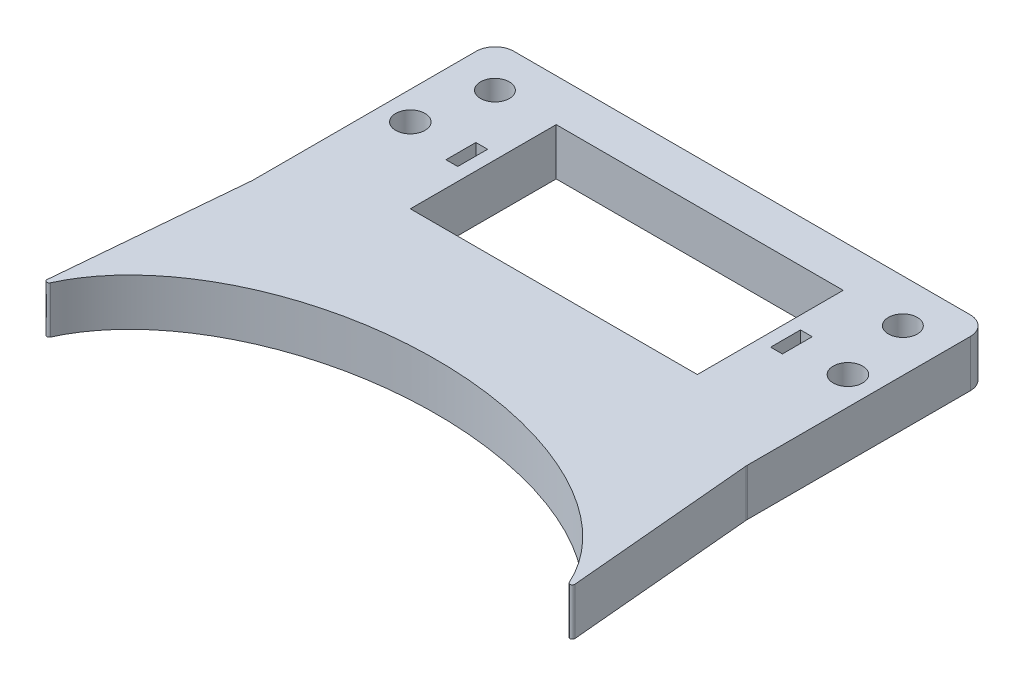
ISO-10303-21;
HEADER;
FILE_DESCRIPTION(('STEP AP214'),'2;1');
FILE_NAME('part.step','',(''),(''),'','','');
FILE_SCHEMA(('AUTOMOTIVE_DESIGN { 1 0 10303 214 1 1 1 1 }'));
ENDSEC;
DATA;
#1=APPLICATION_CONTEXT('core data for automotive mechanical design processes');
#2=APPLICATION_PROTOCOL_DEFINITION('international standard','automotive_design',2000,#1);
#3=PRODUCT_CONTEXT('',#1,'mechanical');
#4=PRODUCT('Part','Part','',(#3));
#5=PRODUCT_RELATED_PRODUCT_CATEGORY('part','',(#4));
#6=PRODUCT_DEFINITION_FORMATION('','',#4);
#7=PRODUCT_DEFINITION_CONTEXT('part definition',#1,'design');
#8=PRODUCT_DEFINITION('design','',#6,#7);
#9=PRODUCT_DEFINITION_SHAPE('','',#8);
#10=(LENGTH_UNIT() NAMED_UNIT(*) SI_UNIT(.MILLI.,.METRE.));
#11=(NAMED_UNIT(*) PLANE_ANGLE_UNIT() SI_UNIT($,.RADIAN.));
#12=(NAMED_UNIT(*) SI_UNIT($,.STERADIAN.) SOLID_ANGLE_UNIT());
#13=UNCERTAINTY_MEASURE_WITH_UNIT(LENGTH_MEASURE(1.E-05),#10,'distance_accuracy_value','');
#14=(GEOMETRIC_REPRESENTATION_CONTEXT(3) GLOBAL_UNCERTAINTY_ASSIGNED_CONTEXT((#13)) GLOBAL_UNIT_ASSIGNED_CONTEXT((#10,
#11,#12)) REPRESENTATION_CONTEXT('',''));
#15=CARTESIAN_POINT('',(0.,0.,0.));
#16=DIRECTION('',(0.,0.,1.));
#17=DIRECTION('',(1.,0.,0.));
#18=AXIS2_PLACEMENT_3D('',#15,#16,#17);
#19=CARTESIAN_POINT('',(0.,10.,0.));
#20=DIRECTION('',(0.,-1.,0.));
#21=DIRECTION('',(0.,0.,-1.));
#22=AXIS2_PLACEMENT_3D('',#19,#20,#21);
#23=PLANE('',#22);
#24=CARTESIAN_POINT('',(43.347709835329,10.,-23.3308146149369));
#25=DIRECTION('',(0.,-1.,0.));
#26=DIRECTION('',(0.,0.,1.));
#27=AXIS2_PLACEMENT_3D('',#24,#25,#26);
#28=CIRCLE('',#27,3.075);
#29=CARTESIAN_POINT('',(43.347709835329,10.,-20.2558146149369));
#30=VERTEX_POINT('',#29);
#31=EDGE_CURVE('E523',#30,#30,#28,.T.);
#32=ORIENTED_EDGE('',*,*,#31,.T.);
#33=EDGE_LOOP('',(#32));
#34=FACE_BOUND('',#33,.T.);
#35=CARTESIAN_POINT('',(0.,9.99999999999999,70.));
#36=DIRECTION('',(0.,1.,0.));
#37=DIRECTION('',(-1.,0.,0.));
#38=AXIS2_PLACEMENT_3D('',#35,#36,#37);
#39=ELLIPSE('',#38,57.5,37.5);
#40=CARTESIAN_POINT('',(-55.1298089989942,9.99999999999999,59.3443052899065));
#41=VERTEX_POINT('',#40);
#42=CARTESIAN_POINT('',(55.1298089989942,9.99999999999999,59.3443052899065));
#43=VERTEX_POINT('',#42);
#44=EDGE_CURVE('E254',#41,#43,#39,.F.);
#45=ORIENTED_EDGE('',*,*,#44,.T.);
#46=CARTESIAN_POINT('',(55.585011775336,10.,59.1374468058874));
#47=DIRECTION('',(0.,-1.,0.));
#48=DIRECTION('',(0.,0.,-1.));
#49=AXIS2_PLACEMENT_3D('',#46,#47,#48);
#50=CIRCLE('',#49,0.5);
#51=CARTESIAN_POINT('',(56.0830231384675,9.99999999999999,59.092897033812));
#52=VERTEX_POINT('',#51);
#53=EDGE_CURVE('E45',#43,#52,#50,.F.);
#54=ORIENTED_EDGE('',*,*,#53,.T.);
#55=DIRECTION('',(-0.0890995441508282,0.,-0.996022726262867));
#56=VECTOR('',#55,1.);
#57=CARTESIAN_POINT('',(50.3935859845895,9.99999999999999,-4.50797498988742));
#58=LINE('',#57,#56);
#59=CARTESIAN_POINT('',(52.5159090949485,9.99999999999999,19.2169729942694));
#60=VERTEX_POINT('',#59);
#61=EDGE_CURVE('E237',#52,#60,#58,.T.);
#62=ORIENTED_EDGE('',*,*,#61,.T.);
#63=CARTESIAN_POINT('',(56.5,10.,18.8605748176661));
#64=DIRECTION('',(0.,-1.,0.));
#65=DIRECTION('',(0.,0.,-1.));
#66=AXIS2_PLACEMENT_3D('',#63,#64,#65);
#67=CIRCLE('',#66,4.);
#68=CARTESIAN_POINT('',(52.5,10.,18.8605748176661));
#69=VERTEX_POINT('',#68);
#70=EDGE_CURVE('E364',#60,#69,#67,.T.);
#71=ORIENTED_EDGE('',*,*,#70,.T.);
#72=DIRECTION('',(0.,0.,-1.));
#73=VECTOR('',#72,1.);
#74=CARTESIAN_POINT('',(52.5,10.,32.5));
#75=LINE('',#74,#73);
#76=CARTESIAN_POINT('',(52.5,10.,-28.5));
#77=VERTEX_POINT('',#76);
#78=EDGE_CURVE('E406',#69,#77,#75,.T.);
#79=ORIENTED_EDGE('',*,*,#78,.T.);
#80=CARTESIAN_POINT('',(48.5,10.,-28.5));
#81=DIRECTION('',(0.,-1.,0.));
#82=DIRECTION('',(0.,0.,-1.));
#83=AXIS2_PLACEMENT_3D('',#80,#81,#82);
#84=CIRCLE('',#83,4.);
#85=CARTESIAN_POINT('',(48.5,10.,-32.5));
#86=VERTEX_POINT('',#85);
#87=EDGE_CURVE('E373',#77,#86,#84,.F.);
#88=ORIENTED_EDGE('',*,*,#87,.T.);
#89=DIRECTION('',(-1.,0.,0.));
#90=VECTOR('',#89,1.);
#91=CARTESIAN_POINT('',(-52.5,10.,-32.5));
#92=LINE('',#91,#90);
#93=CARTESIAN_POINT('',(-48.5,10.,-32.5));
#94=VERTEX_POINT('',#93);
#95=EDGE_CURVE('E416',#86,#94,#92,.T.);
#96=ORIENTED_EDGE('',*,*,#95,.T.);
#97=CARTESIAN_POINT('',(-48.5,10.,-28.5));
#98=DIRECTION('',(0.,-1.,0.));
#99=DIRECTION('',(0.,0.,-1.));
#100=AXIS2_PLACEMENT_3D('',#97,#98,#99);
#101=CIRCLE('',#100,4.);
#102=CARTESIAN_POINT('',(-52.5,10.,-28.5));
#103=VERTEX_POINT('',#102);
#104=EDGE_CURVE('E375',#94,#103,#101,.F.);
#105=ORIENTED_EDGE('',*,*,#104,.T.);
#106=DIRECTION('',(0.,0.,1.));
#107=VECTOR('',#106,1.);
#108=CARTESIAN_POINT('',(-52.5,10.,32.5));
#109=LINE('',#108,#107);
#110=CARTESIAN_POINT('',(-52.5,10.,18.8605748176661));
#111=VERTEX_POINT('',#110);
#112=EDGE_CURVE('E402',#103,#111,#109,.T.);
#113=ORIENTED_EDGE('',*,*,#112,.T.);
#114=CARTESIAN_POINT('',(-56.5,9.99999999999999,18.8605748176661));
#115=DIRECTION('',(0.,-1.,0.));
#116=DIRECTION('',(0.,0.,-1.));
#117=AXIS2_PLACEMENT_3D('',#114,#115,#116);
#118=CIRCLE('',#117,4.);
#119=CARTESIAN_POINT('',(-52.5159090949485,9.99999999999999,19.2169729942694));
#120=VERTEX_POINT('',#119);
#121=EDGE_CURVE('E368',#111,#120,#118,.T.);
#122=ORIENTED_EDGE('',*,*,#121,.T.);
#123=DIRECTION('',(0.0890995441508282,0.,-0.996022726262867));
#124=VECTOR('',#123,1.);
#125=CARTESIAN_POINT('',(-50.3935859845895,9.99999999999999,-4.50797498988742));
#126=LINE('',#125,#124);
#127=CARTESIAN_POINT('',(-56.0830231384675,9.99999999999999,59.092897033812));
#128=VERTEX_POINT('',#127);
#129=EDGE_CURVE('E257',#128,#120,#126,.T.);
#130=ORIENTED_EDGE('',*,*,#129,.F.);
#131=CARTESIAN_POINT('',(-55.585011775336,10.,59.1374468058874));
#132=DIRECTION('',(0.,-1.,0.));
#133=DIRECTION('',(0.,0.,-1.));
#134=AXIS2_PLACEMENT_3D('',#131,#132,#133);
#135=CIRCLE('',#134,0.5);
#136=EDGE_CURVE('E352',#128,#41,#135,.F.);
#137=ORIENTED_EDGE('',*,*,#136,.T.);
#138=EDGE_LOOP('',(#45,#54,#62,#71,#79,#88,#96,#105,#113,#122,#130,#137));
#139=FACE_BOUND('',#138,.T.);
#140=CARTESIAN_POINT('',(46.5,10.,-8.5));
#141=DIRECTION('',(0.,-1.,0.));
#142=DIRECTION('',(0.,0.,1.));
#143=AXIS2_PLACEMENT_3D('',#140,#141,#142);
#144=CIRCLE('',#143,3.125);
#145=CARTESIAN_POINT('',(46.5,10.,-5.375));
#146=VERTEX_POINT('',#145);
#147=EDGE_CURVE('E230',#146,#146,#144,.T.);
#148=ORIENTED_EDGE('',*,*,#147,.T.);
#149=EDGE_LOOP('',(#148));
#150=FACE_BOUND('',#149,.T.);
#151=DIRECTION('',(0.,0.,1.));
#152=VECTOR('',#151,1.);
#153=CARTESIAN_POINT('',(35.75,10.,-11.675));
#154=LINE('',#153,#152);
#155=CARTESIAN_POINT('',(35.75,10.,-11.675));
#156=VERTEX_POINT('',#155);
#157=CARTESIAN_POINT('',(35.75,10.,-5.325));
#158=VERTEX_POINT('',#157);
#159=EDGE_CURVE('E218',#156,#158,#154,.T.);
#160=ORIENTED_EDGE('',*,*,#159,.T.);
#161=DIRECTION('',(-1.,0.,0.));
#162=VECTOR('',#161,1.);
#163=CARTESIAN_POINT('',(33.25,10.,-5.325));
#164=LINE('',#163,#162);
#165=CARTESIAN_POINT('',(33.25,10.,-5.325));
#166=VERTEX_POINT('',#165);
#167=EDGE_CURVE('E224',#158,#166,#164,.T.);
#168=ORIENTED_EDGE('',*,*,#167,.T.);
#169=DIRECTION('',(0.,0.,-1.));
#170=VECTOR('',#169,1.);
#171=CARTESIAN_POINT('',(33.25,10.,-11.675));
#172=LINE('',#171,#170);
#173=CARTESIAN_POINT('',(33.25,10.,-11.675));
#174=VERTEX_POINT('',#173);
#175=EDGE_CURVE('E227',#166,#174,#172,.T.);
#176=ORIENTED_EDGE('',*,*,#175,.T.);
#177=DIRECTION('',(1.,0.,0.));
#178=VECTOR('',#177,1.);
#179=CARTESIAN_POINT('',(33.25,10.,-11.675));
#180=LINE('',#179,#178);
#181=EDGE_CURVE('E236',#174,#156,#180,.T.);
#182=ORIENTED_EDGE('',*,*,#181,.T.);
#183=EDGE_LOOP('',(#160,#168,#176,#182));
#184=FACE_BOUND('',#183,.T.);
#185=CARTESIAN_POINT('',(-43.347709835329,10.,-23.3308146149369));
#186=DIRECTION('',(0.,1.,0.));
#187=DIRECTION('',(0.,0.,1.));
#188=AXIS2_PLACEMENT_3D('',#185,#186,#187);
#189=CIRCLE('',#188,3.075);
#190=CARTESIAN_POINT('',(-43.347709835329,10.,-20.2558146149369));
#191=VERTEX_POINT('',#190);
#192=EDGE_CURVE('E250',#191,#191,#189,.T.);
#193=ORIENTED_EDGE('',*,*,#192,.F.);
#194=EDGE_LOOP('',(#193));
#195=FACE_BOUND('',#194,.T.);
#196=CARTESIAN_POINT('',(-46.5,10.,-8.5));
#197=DIRECTION('',(0.,1.,0.));
#198=DIRECTION('',(0.,0.,1.));
#199=AXIS2_PLACEMENT_3D('',#196,#197,#198);
#200=CIRCLE('',#199,3.125);
#201=CARTESIAN_POINT('',(-46.5,10.,-5.375));
#202=VERTEX_POINT('',#201);
#203=EDGE_CURVE('E463',#202,#202,#200,.T.);
#204=ORIENTED_EDGE('',*,*,#203,.F.);
#205=EDGE_LOOP('',(#204));
#206=FACE_BOUND('',#205,.T.);
#207=DIRECTION('',(1.,0.,0.));
#208=VECTOR('',#207,1.);
#209=CARTESIAN_POINT('',(-33.25,10.,-5.325));
#210=LINE('',#209,#208);
#211=CARTESIAN_POINT('',(-35.75,10.,-5.325));
#212=VERTEX_POINT('',#211);
#213=CARTESIAN_POINT('',(-33.25,10.,-5.325));
#214=VERTEX_POINT('',#213);
#215=EDGE_CURVE('E471',#212,#214,#210,.T.);
#216=ORIENTED_EDGE('',*,*,#215,.F.);
#217=DIRECTION('',(0.,0.,1.));
#218=VECTOR('',#217,1.);
#219=CARTESIAN_POINT('',(-35.75,10.,-11.675));
#220=LINE('',#219,#218);
#221=CARTESIAN_POINT('',(-35.75,10.,-11.675));
#222=VERTEX_POINT('',#221);
#223=EDGE_CURVE('E256',#222,#212,#220,.T.);
#224=ORIENTED_EDGE('',*,*,#223,.F.);
#225=DIRECTION('',(-1.,0.,0.));
#226=VECTOR('',#225,1.);
#227=CARTESIAN_POINT('',(-33.25,10.,-11.675));
#228=LINE('',#227,#226);
#229=CARTESIAN_POINT('',(-33.25,10.,-11.675));
#230=VERTEX_POINT('',#229);
#231=EDGE_CURVE('E464',#230,#222,#228,.T.);
#232=ORIENTED_EDGE('',*,*,#231,.F.);
#233=DIRECTION('',(0.,0.,-1.));
#234=VECTOR('',#233,1.);
#235=CARTESIAN_POINT('',(-33.25,10.,-11.675));
#236=LINE('',#235,#234);
#237=EDGE_CURVE('E468',#214,#230,#236,.T.);
#238=ORIENTED_EDGE('',*,*,#237,.F.);
#239=EDGE_LOOP('',(#216,#224,#232,#238));
#240=FACE_BOUND('',#239,.T.);
#241=DIRECTION('',(-1.,0.,0.));
#242=VECTOR('',#241,1.);
#243=CARTESIAN_POINT('',(-30.5,10.,-23.5));
#244=LINE('',#243,#242);
#245=CARTESIAN_POINT('',(30.5,10.,-23.5));
#246=VERTEX_POINT('',#245);
#247=CARTESIAN_POINT('',(-30.5,10.,-23.5));
#248=VERTEX_POINT('',#247);
#249=EDGE_CURVE('E437',#246,#248,#244,.T.);
#250=ORIENTED_EDGE('',*,*,#249,.F.);
#251=DIRECTION('',(0.,0.,-1.));
#252=VECTOR('',#251,1.);
#253=CARTESIAN_POINT('',(30.5,10.,-23.5));
#254=LINE('',#253,#252);
#255=CARTESIAN_POINT('',(30.5,10.,7.5));
#256=VERTEX_POINT('',#255);
#257=EDGE_CURVE('E440',#256,#246,#254,.T.);
#258=ORIENTED_EDGE('',*,*,#257,.F.);
#259=DIRECTION('',(1.,0.,0.));
#260=VECTOR('',#259,1.);
#261=CARTESIAN_POINT('',(-30.5,10.,7.5));
#262=LINE('',#261,#260);
#263=CARTESIAN_POINT('',(-30.5,10.,7.5));
#264=VERTEX_POINT('',#263);
#265=EDGE_CURVE('E430',#264,#256,#262,.T.);
#266=ORIENTED_EDGE('',*,*,#265,.F.);
#267=DIRECTION('',(0.,0.,1.));
#268=VECTOR('',#267,1.);
#269=CARTESIAN_POINT('',(-30.5,10.,-23.5));
#270=LINE('',#269,#268);
#271=EDGE_CURVE('E434',#248,#264,#270,.T.);
#272=ORIENTED_EDGE('',*,*,#271,.F.);
#273=EDGE_LOOP('',(#250,#258,#266,#272));
#274=FACE_BOUND('',#273,.T.);
#275=ADVANCED_FACE('F37',(#34,#139,#150,#184,#195,#206,#240,#274),#23,.F.);
#276=CARTESIAN_POINT('',(0.,0.,0.));
#277=DIRECTION('',(0.,-1.,0.));
#278=DIRECTION('',(0.,0.,-1.));
#279=AXIS2_PLACEMENT_3D('',#276,#277,#278);
#280=PLANE('',#279);
#281=CARTESIAN_POINT('',(43.347709835329,0.,-23.3308146149369));
#282=DIRECTION('',(0.,-1.,0.));
#283=DIRECTION('',(0.,0.,1.));
#284=AXIS2_PLACEMENT_3D('',#281,#282,#283);
#285=CIRCLE('',#284,3.075);
#286=CARTESIAN_POINT('',(43.347709835329,0.,-20.2558146149369));
#287=VERTEX_POINT('',#286);
#288=EDGE_CURVE('E519',#287,#287,#285,.T.);
#289=ORIENTED_EDGE('',*,*,#288,.F.);
#290=EDGE_LOOP('',(#289));
#291=FACE_BOUND('',#290,.T.);
#292=DIRECTION('',(0.0890995441508282,0.,0.996022726262867));
#293=VECTOR('',#292,1.);
#294=CARTESIAN_POINT('',(50.3935859845895,0.,-4.50797498988742));
#295=LINE('',#294,#293);
#296=CARTESIAN_POINT('',(52.5159090949485,0.,19.2169729942694));
#297=VERTEX_POINT('',#296);
#298=CARTESIAN_POINT('',(56.0830231384675,0.,59.092897033812));
#299=VERTEX_POINT('',#298);
#300=EDGE_CURVE('E516',#297,#299,#295,.T.);
#301=ORIENTED_EDGE('',*,*,#300,.T.);
#302=CARTESIAN_POINT('',(55.585011775336,0.,59.1374468058874));
#303=DIRECTION('',(0.,-1.,0.));
#304=DIRECTION('',(0.,0.,-1.));
#305=AXIS2_PLACEMENT_3D('',#302,#303,#304);
#306=CIRCLE('',#305,0.5);
#307=CARTESIAN_POINT('',(55.1298089989942,0.,59.3443052899065));
#308=VERTEX_POINT('',#307);
#309=EDGE_CURVE('E359',#299,#308,#306,.T.);
#310=ORIENTED_EDGE('',*,*,#309,.T.);
#311=CARTESIAN_POINT('',(0.,0.,70.));
#312=DIRECTION('',(0.,1.,0.));
#313=DIRECTION('',(-1.,0.,0.));
#314=AXIS2_PLACEMENT_3D('',#311,#312,#313);
#315=ELLIPSE('',#314,57.5,37.5);
#316=CARTESIAN_POINT('',(-55.1298089989942,0.,59.3443052899065));
#317=VERTEX_POINT('',#316);
#318=EDGE_CURVE('E249',#308,#317,#315,.T.);
#319=ORIENTED_EDGE('',*,*,#318,.T.);
#320=CARTESIAN_POINT('',(-55.585011775336,0.,59.1374468058874));
#321=DIRECTION('',(0.,-1.,0.));
#322=DIRECTION('',(0.,0.,-1.));
#323=AXIS2_PLACEMENT_3D('',#320,#321,#322);
#324=CIRCLE('',#323,0.5);
#325=CARTESIAN_POINT('',(-56.0830231384675,0.,59.092897033812));
#326=VERTEX_POINT('',#325);
#327=EDGE_CURVE('E361',#317,#326,#324,.T.);
#328=ORIENTED_EDGE('',*,*,#327,.T.);
#329=DIRECTION('',(-0.0890995441508282,0.,0.996022726262867));
#330=VECTOR('',#329,1.);
#331=CARTESIAN_POINT('',(-50.3935859845895,0.,-4.50797498988742));
#332=LINE('',#331,#330);
#333=CARTESIAN_POINT('',(-52.5159090949485,0.,19.2169729942694));
#334=VERTEX_POINT('',#333);
#335=EDGE_CURVE('E489',#334,#326,#332,.T.);
#336=ORIENTED_EDGE('',*,*,#335,.F.);
#337=CARTESIAN_POINT('',(-56.5,0.,18.8605748176661));
#338=DIRECTION('',(0.,-1.,0.));
#339=DIRECTION('',(0.,0.,-1.));
#340=AXIS2_PLACEMENT_3D('',#337,#338,#339);
#341=CIRCLE('',#340,4.);
#342=CARTESIAN_POINT('',(-52.5,0.,18.8605748176661));
#343=VERTEX_POINT('',#342);
#344=EDGE_CURVE('E371',#334,#343,#341,.F.);
#345=ORIENTED_EDGE('',*,*,#344,.T.);
#346=DIRECTION('',(0.,0.,1.));
#347=VECTOR('',#346,1.);
#348=CARTESIAN_POINT('',(-52.5,0.,32.5));
#349=LINE('',#348,#347);
#350=CARTESIAN_POINT('',(-52.5,0.,-28.5));
#351=VERTEX_POINT('',#350);
#352=EDGE_CURVE('E403',#351,#343,#349,.T.);
#353=ORIENTED_EDGE('',*,*,#352,.F.);
#354=CARTESIAN_POINT('',(-48.5,0.,-28.5));
#355=DIRECTION('',(0.,-1.,0.));
#356=DIRECTION('',(0.,0.,-1.));
#357=AXIS2_PLACEMENT_3D('',#354,#355,#356);
#358=CIRCLE('',#357,4.);
#359=CARTESIAN_POINT('',(-48.5,0.,-32.5));
#360=VERTEX_POINT('',#359);
#361=EDGE_CURVE('E379',#351,#360,#358,.T.);
#362=ORIENTED_EDGE('',*,*,#361,.T.);
#363=DIRECTION('',(-1.,0.,0.));
#364=VECTOR('',#363,1.);
#365=CARTESIAN_POINT('',(-52.5,0.,-32.5));
#366=LINE('',#365,#364);
#367=CARTESIAN_POINT('',(48.5,0.,-32.5));
#368=VERTEX_POINT('',#367);
#369=EDGE_CURVE('E407',#368,#360,#366,.T.);
#370=ORIENTED_EDGE('',*,*,#369,.F.);
#371=CARTESIAN_POINT('',(48.5,0.,-28.5));
#372=DIRECTION('',(0.,-1.,0.));
#373=DIRECTION('',(0.,0.,-1.));
#374=AXIS2_PLACEMENT_3D('',#371,#372,#373);
#375=CIRCLE('',#374,4.);
#376=CARTESIAN_POINT('',(52.5,0.,-28.5));
#377=VERTEX_POINT('',#376);
#378=EDGE_CURVE('E377',#368,#377,#375,.T.);
#379=ORIENTED_EDGE('',*,*,#378,.T.);
#380=DIRECTION('',(0.,0.,-1.));
#381=VECTOR('',#380,1.);
#382=CARTESIAN_POINT('',(52.5,0.,32.5));
#383=LINE('',#382,#381);
#384=CARTESIAN_POINT('',(52.5,0.,18.8605748176661));
#385=VERTEX_POINT('',#384);
#386=EDGE_CURVE('E410',#385,#377,#383,.T.);
#387=ORIENTED_EDGE('',*,*,#386,.F.);
#388=CARTESIAN_POINT('',(56.5,0.,18.8605748176661));
#389=DIRECTION('',(0.,-1.,0.));
#390=DIRECTION('',(0.,0.,-1.));
#391=AXIS2_PLACEMENT_3D('',#388,#389,#390);
#392=CIRCLE('',#391,4.);
#393=EDGE_CURVE('E366',#385,#297,#392,.F.);
#394=ORIENTED_EDGE('',*,*,#393,.T.);
#395=EDGE_LOOP('',(#301,#310,#319,#328,#336,#345,#353,#362,#370,#379,#387,#394));
#396=FACE_BOUND('',#395,.T.);
#397=DIRECTION('',(-1.,0.,0.));
#398=VECTOR('',#397,1.);
#399=CARTESIAN_POINT('',(33.25,0.,-5.325));
#400=LINE('',#399,#398);
#401=CARTESIAN_POINT('',(35.75,0.,-5.325));
#402=VERTEX_POINT('',#401);
#403=CARTESIAN_POINT('',(33.25,0.,-5.325));
#404=VERTEX_POINT('',#403);
#405=EDGE_CURVE('E219',#402,#404,#400,.T.);
#406=ORIENTED_EDGE('',*,*,#405,.F.);
#407=DIRECTION('',(0.,0.,1.));
#408=VECTOR('',#407,1.);
#409=CARTESIAN_POINT('',(35.75,0.,-11.675));
#410=LINE('',#409,#408);
#411=CARTESIAN_POINT('',(35.75,0.,-11.675));
#412=VERTEX_POINT('',#411);
#413=EDGE_CURVE('E211',#412,#402,#410,.T.);
#414=ORIENTED_EDGE('',*,*,#413,.F.);
#415=DIRECTION('',(1.,0.,0.));
#416=VECTOR('',#415,1.);
#417=CARTESIAN_POINT('',(33.25,0.,-11.675));
#418=LINE('',#417,#416);
#419=CARTESIAN_POINT('',(33.25,0.,-11.675));
#420=VERTEX_POINT('',#419);
#421=EDGE_CURVE('E199',#420,#412,#418,.T.);
#422=ORIENTED_EDGE('',*,*,#421,.F.);
#423=DIRECTION('',(0.,0.,-1.));
#424=VECTOR('',#423,1.);
#425=CARTESIAN_POINT('',(33.25,0.,-11.675));
#426=LINE('',#425,#424);
#427=EDGE_CURVE('E210',#404,#420,#426,.T.);
#428=ORIENTED_EDGE('',*,*,#427,.F.);
#429=EDGE_LOOP('',(#406,#414,#422,#428));
#430=FACE_BOUND('',#429,.T.);
#431=CARTESIAN_POINT('',(-46.5,0.,-8.5));
#432=DIRECTION('',(0.,1.,0.));
#433=DIRECTION('',(0.,0.,1.));
#434=AXIS2_PLACEMENT_3D('',#431,#432,#433);
#435=CIRCLE('',#434,3.125);
#436=CARTESIAN_POINT('',(-46.5,0.,-5.375));
#437=VERTEX_POINT('',#436);
#438=EDGE_CURVE('E442',#437,#437,#435,.T.);
#439=ORIENTED_EDGE('',*,*,#438,.T.);
#440=EDGE_LOOP('',(#439));
#441=FACE_BOUND('',#440,.T.);
#442=DIRECTION('',(0.,0.,1.));
#443=VECTOR('',#442,1.);
#444=CARTESIAN_POINT('',(-35.75,0.,-11.675));
#445=LINE('',#444,#443);
#446=CARTESIAN_POINT('',(-35.75,0.,-11.675));
#447=VERTEX_POINT('',#446);
#448=CARTESIAN_POINT('',(-35.75,0.,-5.325));
#449=VERTEX_POINT('',#448);
#450=EDGE_CURVE('E467',#447,#449,#445,.T.);
#451=ORIENTED_EDGE('',*,*,#450,.T.);
#452=DIRECTION('',(1.,0.,0.));
#453=VECTOR('',#452,1.);
#454=CARTESIAN_POINT('',(-33.25,0.,-5.325));
#455=LINE('',#454,#453);
#456=CARTESIAN_POINT('',(-33.25,0.,-5.325));
#457=VERTEX_POINT('',#456);
#458=EDGE_CURVE('E480',#449,#457,#455,.T.);
#459=ORIENTED_EDGE('',*,*,#458,.T.);
#460=DIRECTION('',(0.,0.,-1.));
#461=VECTOR('',#460,1.);
#462=CARTESIAN_POINT('',(-33.25,0.,-11.675));
#463=LINE('',#462,#461);
#464=CARTESIAN_POINT('',(-33.25,0.,-11.675));
#465=VERTEX_POINT('',#464);
#466=EDGE_CURVE('E477',#457,#465,#463,.T.);
#467=ORIENTED_EDGE('',*,*,#466,.T.);
#468=DIRECTION('',(-1.,0.,0.));
#469=VECTOR('',#468,1.);
#470=CARTESIAN_POINT('',(-33.25,0.,-11.675));
#471=LINE('',#470,#469);
#472=EDGE_CURVE('E457',#465,#447,#471,.T.);
#473=ORIENTED_EDGE('',*,*,#472,.T.);
#474=EDGE_LOOP('',(#451,#459,#467,#473));
#475=FACE_BOUND('',#474,.T.);
#476=DIRECTION('',(0.,0.,-1.));
#477=VECTOR('',#476,1.);
#478=CARTESIAN_POINT('',(30.5,0.,-23.5));
#479=LINE('',#478,#477);
#480=CARTESIAN_POINT('',(30.5,0.,7.5));
#481=VERTEX_POINT('',#480);
#482=CARTESIAN_POINT('',(30.5,0.,-23.5));
#483=VERTEX_POINT('',#482);
#484=EDGE_CURVE('E433',#481,#483,#479,.T.);
#485=ORIENTED_EDGE('',*,*,#484,.T.);
#486=DIRECTION('',(-1.,0.,0.));
#487=VECTOR('',#486,1.);
#488=CARTESIAN_POINT('',(-30.5,0.,-23.5));
#489=LINE('',#488,#487);
#490=CARTESIAN_POINT('',(-30.5,0.,-23.5));
#491=VERTEX_POINT('',#490);
#492=EDGE_CURVE('E448',#483,#491,#489,.T.);
#493=ORIENTED_EDGE('',*,*,#492,.T.);
#494=DIRECTION('',(0.,0.,1.));
#495=VECTOR('',#494,1.);
#496=CARTESIAN_POINT('',(-30.5,0.,-23.5));
#497=LINE('',#496,#495);
#498=CARTESIAN_POINT('',(-30.5,0.,7.5));
#499=VERTEX_POINT('',#498);
#500=EDGE_CURVE('E445',#491,#499,#497,.T.);
#501=ORIENTED_EDGE('',*,*,#500,.T.);
#502=DIRECTION('',(1.,0.,0.));
#503=VECTOR('',#502,1.);
#504=CARTESIAN_POINT('',(-30.5,0.,7.5));
#505=LINE('',#504,#503);
#506=EDGE_CURVE('E425',#499,#481,#505,.T.);
#507=ORIENTED_EDGE('',*,*,#506,.T.);
#508=EDGE_LOOP('',(#485,#493,#501,#507));
#509=FACE_BOUND('',#508,.T.);
#510=CARTESIAN_POINT('',(-43.347709835329,0.,-23.3308146149369));
#511=DIRECTION('',(0.,1.,0.));
#512=DIRECTION('',(0.,0.,1.));
#513=AXIS2_PLACEMENT_3D('',#510,#511,#512);
#514=CIRCLE('',#513,3.075);
#515=CARTESIAN_POINT('',(-43.347709835329,0.,-20.2558146149369));
#516=VERTEX_POINT('',#515);
#517=EDGE_CURVE('E246',#516,#516,#514,.T.);
#518=ORIENTED_EDGE('',*,*,#517,.T.);
#519=EDGE_LOOP('',(#518));
#520=FACE_BOUND('',#519,.T.);
#521=CARTESIAN_POINT('',(46.5,0.,-8.5));
#522=DIRECTION('',(0.,-1.,0.));
#523=DIRECTION('',(0.,0.,1.));
#524=AXIS2_PLACEMENT_3D('',#521,#522,#523);
#525=CIRCLE('',#524,3.125);
#526=CARTESIAN_POINT('',(46.5,0.,-5.375));
#527=VERTEX_POINT('',#526);
#528=EDGE_CURVE('E253',#527,#527,#525,.T.);
#529=ORIENTED_EDGE('',*,*,#528,.F.);
#530=EDGE_LOOP('',(#529));
#531=FACE_BOUND('',#530,.T.);
#532=ADVANCED_FACE('F222',(#291,#396,#430,#441,#475,#509,#520,#531),#280,.T.);
#533=CARTESIAN_POINT('',(52.5,10.,32.5));
#534=DIRECTION('',(-1.,0.,0.));
#535=DIRECTION('',(0.,0.,1.));
#536=AXIS2_PLACEMENT_3D('',#533,#534,#535);
#537=PLANE('',#536);
#538=ORIENTED_EDGE('',*,*,#78,.F.);
#539=DIRECTION('',(0.,-1.,0.));
#540=VECTOR('',#539,1.);
#541=CARTESIAN_POINT('',(52.5,10.,18.8605748176661));
#542=LINE('',#541,#540);
#543=EDGE_CURVE('E389',#69,#385,#542,.T.);
#544=ORIENTED_EDGE('',*,*,#543,.T.);
#545=ORIENTED_EDGE('',*,*,#386,.T.);
#546=DIRECTION('',(0.,-1.,0.));
#547=VECTOR('',#546,1.);
#548=CARTESIAN_POINT('',(52.5,10.,-28.5));
#549=LINE('',#548,#547);
#550=EDGE_CURVE('E392',#377,#77,#549,.F.);
#551=ORIENTED_EDGE('',*,*,#550,.T.);
#552=EDGE_LOOP('',(#538,#544,#545,#551));
#553=FACE_BOUND('',#552,.T.);
#554=ADVANCED_FACE('F311',(#553),#537,.F.);
#555=CARTESIAN_POINT('',(-52.5,10.,-32.5));
#556=DIRECTION('',(0.,0.,1.));
#557=DIRECTION('',(1.,0.,0.));
#558=AXIS2_PLACEMENT_3D('',#555,#556,#557);
#559=PLANE('',#558);
#560=ORIENTED_EDGE('',*,*,#95,.F.);
#561=DIRECTION('',(0.,-1.,0.));
#562=VECTOR('',#561,1.);
#563=CARTESIAN_POINT('',(48.5,10.,-32.5));
#564=LINE('',#563,#562);
#565=EDGE_CURVE('E381',#86,#368,#564,.T.);
#566=ORIENTED_EDGE('',*,*,#565,.T.);
#567=ORIENTED_EDGE('',*,*,#369,.T.);
#568=DIRECTION('',(0.,-1.,0.));
#569=VECTOR('',#568,1.);
#570=CARTESIAN_POINT('',(-48.5,10.,-32.5));
#571=LINE('',#570,#569);
#572=EDGE_CURVE('E384',#360,#94,#571,.F.);
#573=ORIENTED_EDGE('',*,*,#572,.T.);
#574=EDGE_LOOP('',(#560,#566,#567,#573));
#575=FACE_BOUND('',#574,.T.);
#576=ADVANCED_FACE('F315',(#575),#559,.F.);
#577=CARTESIAN_POINT('',(-52.5,10.,32.5));
#578=DIRECTION('',(1.,0.,0.));
#579=DIRECTION('',(0.,0.,-1.));
#580=AXIS2_PLACEMENT_3D('',#577,#578,#579);
#581=PLANE('',#580);
#582=ORIENTED_EDGE('',*,*,#352,.T.);
#583=DIRECTION('',(0.,-1.,0.));
#584=VECTOR('',#583,1.);
#585=CARTESIAN_POINT('',(-52.5,9.99999999999999,18.8605748176661));
#586=LINE('',#585,#584);
#587=EDGE_CURVE('E394',#343,#111,#586,.F.);
#588=ORIENTED_EDGE('',*,*,#587,.T.);
#589=ORIENTED_EDGE('',*,*,#112,.F.);
#590=DIRECTION('',(0.,-1.,0.));
#591=VECTOR('',#590,1.);
#592=CARTESIAN_POINT('',(-52.5,10.,-28.5));
#593=LINE('',#592,#591);
#594=EDGE_CURVE('E396',#103,#351,#593,.T.);
#595=ORIENTED_EDGE('',*,*,#594,.T.);
#596=EDGE_LOOP('',(#582,#588,#589,#595));
#597=FACE_BOUND('',#596,.T.);
#598=ADVANCED_FACE('F304',(#597),#581,.F.);
#599=CARTESIAN_POINT('',(30.5,0.,-23.5));
#600=DIRECTION('',(1.,0.,0.));
#601=DIRECTION('',(0.,0.,-1.));
#602=AXIS2_PLACEMENT_3D('',#599,#600,#601);
#603=PLANE('',#602);
#604=ORIENTED_EDGE('',*,*,#257,.T.);
#605=DIRECTION('',(0.,1.,0.));
#606=VECTOR('',#605,1.);
#607=CARTESIAN_POINT('',(30.5,0.,-23.5));
#608=LINE('',#607,#606);
#609=EDGE_CURVE('E421',#483,#246,#608,.T.);
#610=ORIENTED_EDGE('',*,*,#609,.F.);
#611=ORIENTED_EDGE('',*,*,#484,.F.);
#612=DIRECTION('',(0.,1.,0.));
#613=VECTOR('',#612,1.);
#614=CARTESIAN_POINT('',(30.5,0.,7.5));
#615=LINE('',#614,#613);
#616=EDGE_CURVE('E413',#481,#256,#615,.T.);
#617=ORIENTED_EDGE('',*,*,#616,.T.);
#618=EDGE_LOOP('',(#604,#610,#611,#617));
#619=FACE_BOUND('',#618,.T.);
#620=ADVANCED_FACE('F294',(#619),#603,.F.);
#621=CARTESIAN_POINT('',(-30.5,0.,7.5));
#622=DIRECTION('',(0.,0.,1.));
#623=DIRECTION('',(1.,0.,0.));
#624=AXIS2_PLACEMENT_3D('',#621,#622,#623);
#625=PLANE('',#624);
#626=ORIENTED_EDGE('',*,*,#265,.T.);
#627=ORIENTED_EDGE('',*,*,#616,.F.);
#628=ORIENTED_EDGE('',*,*,#506,.F.);
#629=DIRECTION('',(0.,1.,0.));
#630=VECTOR('',#629,1.);
#631=CARTESIAN_POINT('',(-30.5,0.,7.5));
#632=LINE('',#631,#630);
#633=EDGE_CURVE('E427',#499,#264,#632,.T.);
#634=ORIENTED_EDGE('',*,*,#633,.T.);
#635=EDGE_LOOP('',(#626,#627,#628,#634));
#636=FACE_BOUND('',#635,.T.);
#637=ADVANCED_FACE('F290',(#636),#625,.F.);
#638=CARTESIAN_POINT('',(-30.5,0.,-23.5));
#639=DIRECTION('',(-1.,0.,0.));
#640=DIRECTION('',(0.,0.,1.));
#641=AXIS2_PLACEMENT_3D('',#638,#639,#640);
#642=PLANE('',#641);
#643=ORIENTED_EDGE('',*,*,#271,.T.);
#644=ORIENTED_EDGE('',*,*,#633,.F.);
#645=ORIENTED_EDGE('',*,*,#500,.F.);
#646=DIRECTION('',(0.,1.,0.));
#647=VECTOR('',#646,1.);
#648=CARTESIAN_POINT('',(-30.5,0.,-23.5));
#649=LINE('',#648,#647);
#650=EDGE_CURVE('E424',#491,#248,#649,.T.);
#651=ORIENTED_EDGE('',*,*,#650,.T.);
#652=EDGE_LOOP('',(#643,#644,#645,#651));
#653=FACE_BOUND('',#652,.T.);
#654=ADVANCED_FACE('F293',(#653),#642,.F.);
#655=CARTESIAN_POINT('',(-30.5,0.,-23.5));
#656=DIRECTION('',(0.,0.,-1.));
#657=DIRECTION('',(-1.,0.,0.));
#658=AXIS2_PLACEMENT_3D('',#655,#656,#657);
#659=PLANE('',#658);
#660=ORIENTED_EDGE('',*,*,#249,.T.);
#661=ORIENTED_EDGE('',*,*,#650,.F.);
#662=ORIENTED_EDGE('',*,*,#492,.F.);
#663=ORIENTED_EDGE('',*,*,#609,.T.);
#664=EDGE_LOOP('',(#660,#661,#662,#663));
#665=FACE_BOUND('',#664,.T.);
#666=ADVANCED_FACE('F288',(#665),#659,.F.);
#667=CARTESIAN_POINT('',(-35.75,0.,-11.675));
#668=DIRECTION('',(-1.,0.,0.));
#669=DIRECTION('',(0.,0.,1.));
#670=AXIS2_PLACEMENT_3D('',#667,#668,#669);
#671=PLANE('',#670);
#672=ORIENTED_EDGE('',*,*,#223,.T.);
#673=DIRECTION('',(0.,1.,0.));
#674=VECTOR('',#673,1.);
#675=CARTESIAN_POINT('',(-35.75,0.,-5.325));
#676=LINE('',#675,#674);
#677=EDGE_CURVE('E453',#449,#212,#676,.T.);
#678=ORIENTED_EDGE('',*,*,#677,.F.);
#679=ORIENTED_EDGE('',*,*,#450,.F.);
#680=DIRECTION('',(0.,1.,0.));
#681=VECTOR('',#680,1.);
#682=CARTESIAN_POINT('',(-35.75,0.,-11.675));
#683=LINE('',#682,#681);
#684=EDGE_CURVE('E461',#447,#222,#683,.T.);
#685=ORIENTED_EDGE('',*,*,#684,.T.);
#686=EDGE_LOOP('',(#672,#678,#679,#685));
#687=FACE_BOUND('',#686,.T.);
#688=ADVANCED_FACE('F278',(#687),#671,.F.);
#689=CARTESIAN_POINT('',(-33.25,0.,-11.675));
#690=DIRECTION('',(0.,0.,-1.));
#691=DIRECTION('',(-1.,0.,0.));
#692=AXIS2_PLACEMENT_3D('',#689,#690,#691);
#693=PLANE('',#692);
#694=ORIENTED_EDGE('',*,*,#231,.T.);
#695=ORIENTED_EDGE('',*,*,#684,.F.);
#696=ORIENTED_EDGE('',*,*,#472,.F.);
#697=DIRECTION('',(0.,1.,0.));
#698=VECTOR('',#697,1.);
#699=CARTESIAN_POINT('',(-33.25,0.,-11.675));
#700=LINE('',#699,#698);
#701=EDGE_CURVE('E459',#465,#230,#700,.T.);
#702=ORIENTED_EDGE('',*,*,#701,.T.);
#703=EDGE_LOOP('',(#694,#695,#696,#702));
#704=FACE_BOUND('',#703,.T.);
#705=ADVANCED_FACE('F274',(#704),#693,.F.);
#706=CARTESIAN_POINT('',(-33.25,0.,-11.675));
#707=DIRECTION('',(1.,0.,0.));
#708=DIRECTION('',(0.,0.,-1.));
#709=AXIS2_PLACEMENT_3D('',#706,#707,#708);
#710=PLANE('',#709);
#711=ORIENTED_EDGE('',*,*,#237,.T.);
#712=ORIENTED_EDGE('',*,*,#701,.F.);
#713=ORIENTED_EDGE('',*,*,#466,.F.);
#714=DIRECTION('',(0.,1.,0.));
#715=VECTOR('',#714,1.);
#716=CARTESIAN_POINT('',(-33.25,0.,-5.325));
#717=LINE('',#716,#715);
#718=EDGE_CURVE('E456',#457,#214,#717,.T.);
#719=ORIENTED_EDGE('',*,*,#718,.T.);
#720=EDGE_LOOP('',(#711,#712,#713,#719));
#721=FACE_BOUND('',#720,.T.);
#722=ADVANCED_FACE('F277',(#721),#710,.F.);
#723=CARTESIAN_POINT('',(-33.25,0.,-5.325));
#724=DIRECTION('',(0.,0.,1.));
#725=DIRECTION('',(1.,0.,0.));
#726=AXIS2_PLACEMENT_3D('',#723,#724,#725);
#727=PLANE('',#726);
#728=ORIENTED_EDGE('',*,*,#215,.T.);
#729=ORIENTED_EDGE('',*,*,#718,.F.);
#730=ORIENTED_EDGE('',*,*,#458,.F.);
#731=ORIENTED_EDGE('',*,*,#677,.T.);
#732=EDGE_LOOP('',(#728,#729,#730,#731));
#733=FACE_BOUND('',#732,.T.);
#734=ADVANCED_FACE('F272',(#733),#727,.F.);
#735=CARTESIAN_POINT('',(-46.5,0.,-8.5));
#736=DIRECTION('',(0.,1.,0.));
#737=DIRECTION('',(0.,0.,1.));
#738=AXIS2_PLACEMENT_3D('',#735,#736,#737);
#739=CYLINDRICAL_SURFACE('',#738,3.125);
#740=ORIENTED_EDGE('',*,*,#438,.F.);
#741=EDGE_LOOP('',(#740));
#742=FACE_BOUND('',#741,.T.);
#743=ORIENTED_EDGE('',*,*,#203,.T.);
#744=EDGE_LOOP('',(#743));
#745=FACE_BOUND('',#744,.T.);
#746=ADVANCED_FACE('F269',(#742,#745),#739,.F.);
#747=CARTESIAN_POINT('',(-50.3935859845895,81.3475173027588,-4.50797498988742));
#748=DIRECTION('',(0.996022726262867,0.,0.0890995441508282));
#749=DIRECTION('',(0.0890995441508282,0.,-0.996022726262867));
#750=AXIS2_PLACEMENT_3D('',#747,#748,#749);
#751=PLANE('',#750);
#752=ORIENTED_EDGE('',*,*,#335,.T.);
#753=DIRECTION('',(0.,1.,0.));
#754=VECTOR('',#753,1.);
#755=CARTESIAN_POINT('',(-56.0830231384675,9.99999999999999,59.092897033812));
#756=LINE('',#755,#754);
#757=EDGE_CURVE('E11',#326,#128,#756,.T.);
#758=ORIENTED_EDGE('',*,*,#757,.T.);
#759=ORIENTED_EDGE('',*,*,#129,.T.);
#760=DIRECTION('',(0.,-1.,0.));
#761=VECTOR('',#760,1.);
#762=CARTESIAN_POINT('',(-52.5159090949485,0.,19.2169729942694));
#763=LINE('',#762,#761);
#764=EDGE_CURVE('E399',#120,#334,#763,.T.);
#765=ORIENTED_EDGE('',*,*,#764,.T.);
#766=EDGE_LOOP('',(#752,#758,#759,#765));
#767=FACE_BOUND('',#766,.T.);
#768=ADVANCED_FACE('F267',(#767),#751,.F.);
#769=CARTESIAN_POINT('',(0.,81.3475173027588,70.));
#770=DIRECTION('',(0.,1.,0.));
#771=DIRECTION('',(-1.,0.,0.));
#772=AXIS2_PLACEMENT_3D('',#769,#770,#771);
#773=ELLIPSE('',#772,57.5,37.5);
#774=DIRECTION('',(0.,-1.,0.));
#775=VECTOR('',#774,1.);
#776=SURFACE_OF_LINEAR_EXTRUSION('',#773,#775);
#777=ORIENTED_EDGE('',*,*,#318,.F.);
#778=DIRECTION('',(0.,-1.,0.));
#779=VECTOR('',#778,1.);
#780=CARTESIAN_POINT('',(55.1298089989942,0.,59.3443052899065));
#781=LINE('',#780,#779);
#782=EDGE_CURVE('E58',#308,#43,#781,.F.);
#783=ORIENTED_EDGE('',*,*,#782,.T.);
#784=ORIENTED_EDGE('',*,*,#44,.F.);
#785=DIRECTION('',(0.,-1.,0.));
#786=VECTOR('',#785,1.);
#787=CARTESIAN_POINT('',(-55.1298089989942,9.99999999999999,59.3443052899065));
#788=LINE('',#787,#786);
#789=EDGE_CURVE('E356',#41,#317,#788,.T.);
#790=ORIENTED_EDGE('',*,*,#789,.T.);
#791=EDGE_LOOP('',(#777,#783,#784,#790));
#792=FACE_BOUND('',#791,.T.);
#793=ADVANCED_FACE('F262',(#792),#776,.T.);
#794=CARTESIAN_POINT('',(-43.347709835329,0.,-23.3308146149369));
#795=DIRECTION('',(0.,1.,0.));
#796=DIRECTION('',(0.,0.,1.));
#797=AXIS2_PLACEMENT_3D('',#794,#795,#796);
#798=CYLINDRICAL_SURFACE('',#797,3.075);
#799=ORIENTED_EDGE('',*,*,#517,.F.);
#800=EDGE_LOOP('',(#799));
#801=FACE_BOUND('',#800,.T.);
#802=ORIENTED_EDGE('',*,*,#192,.T.);
#803=EDGE_LOOP('',(#802));
#804=FACE_BOUND('',#803,.T.);
#805=ADVANCED_FACE('F266',(#801,#804),#798,.F.);
#806=CARTESIAN_POINT('',(35.75,0.,-11.675));
#807=DIRECTION('',(-1.,0.,0.));
#808=DIRECTION('',(0.,0.,1.));
#809=AXIS2_PLACEMENT_3D('',#806,#807,#808);
#810=PLANE('',#809);
#811=ORIENTED_EDGE('',*,*,#159,.F.);
#812=DIRECTION('',(0.,1.,0.));
#813=VECTOR('',#812,1.);
#814=CARTESIAN_POINT('',(35.75,0.,-11.675));
#815=LINE('',#814,#813);
#816=EDGE_CURVE('E203',#412,#156,#815,.T.);
#817=ORIENTED_EDGE('',*,*,#816,.F.);
#818=ORIENTED_EDGE('',*,*,#413,.T.);
#819=DIRECTION('',(0.,1.,0.));
#820=VECTOR('',#819,1.);
#821=CARTESIAN_POINT('',(35.75,0.,-5.325));
#822=LINE('',#821,#820);
#823=EDGE_CURVE('E241',#402,#158,#822,.T.);
#824=ORIENTED_EDGE('',*,*,#823,.T.);
#825=EDGE_LOOP('',(#811,#817,#818,#824));
#826=FACE_BOUND('',#825,.T.);
#827=ADVANCED_FACE('F214',(#826),#810,.T.);
#828=CARTESIAN_POINT('',(33.25,0.,-5.325));
#829=DIRECTION('',(0.,0.,-1.));
#830=DIRECTION('',(-1.,0.,0.));
#831=AXIS2_PLACEMENT_3D('',#828,#829,#830);
#832=PLANE('',#831);
#833=ORIENTED_EDGE('',*,*,#167,.F.);
#834=ORIENTED_EDGE('',*,*,#823,.F.);
#835=ORIENTED_EDGE('',*,*,#405,.T.);
#836=DIRECTION('',(0.,1.,0.));
#837=VECTOR('',#836,1.);
#838=CARTESIAN_POINT('',(33.25,0.,-5.325));
#839=LINE('',#838,#837);
#840=EDGE_CURVE('E243',#404,#166,#839,.T.);
#841=ORIENTED_EDGE('',*,*,#840,.T.);
#842=EDGE_LOOP('',(#833,#834,#835,#841));
#843=FACE_BOUND('',#842,.T.);
#844=ADVANCED_FACE('F545',(#843),#832,.T.);
#845=CARTESIAN_POINT('',(33.25,0.,-11.675));
#846=DIRECTION('',(1.,0.,0.));
#847=DIRECTION('',(0.,0.,-1.));
#848=AXIS2_PLACEMENT_3D('',#845,#846,#847);
#849=PLANE('',#848);
#850=ORIENTED_EDGE('',*,*,#175,.F.);
#851=ORIENTED_EDGE('',*,*,#840,.F.);
#852=ORIENTED_EDGE('',*,*,#427,.T.);
#853=DIRECTION('',(0.,1.,0.));
#854=VECTOR('',#853,1.);
#855=CARTESIAN_POINT('',(33.25,0.,-11.675));
#856=LINE('',#855,#854);
#857=EDGE_CURVE('E205',#420,#174,#856,.T.);
#858=ORIENTED_EDGE('',*,*,#857,.T.);
#859=EDGE_LOOP('',(#850,#851,#852,#858));
#860=FACE_BOUND('',#859,.T.);
#861=ADVANCED_FACE('F541',(#860),#849,.T.);
#862=CARTESIAN_POINT('',(33.25,0.,-11.675));
#863=DIRECTION('',(0.,0.,1.));
#864=DIRECTION('',(1.,0.,0.));
#865=AXIS2_PLACEMENT_3D('',#862,#863,#864);
#866=PLANE('',#865);
#867=ORIENTED_EDGE('',*,*,#181,.F.);
#868=ORIENTED_EDGE('',*,*,#857,.F.);
#869=ORIENTED_EDGE('',*,*,#421,.T.);
#870=ORIENTED_EDGE('',*,*,#816,.T.);
#871=EDGE_LOOP('',(#867,#868,#869,#870));
#872=FACE_BOUND('',#871,.T.);
#873=ADVANCED_FACE('F202',(#872),#866,.T.);
#874=CARTESIAN_POINT('',(46.5,0.,-8.5));
#875=DIRECTION('',(0.,1.,0.));
#876=DIRECTION('',(0.,0.,1.));
#877=AXIS2_PLACEMENT_3D('',#874,#875,#876);
#878=CYLINDRICAL_SURFACE('',#877,3.125);
#879=ORIENTED_EDGE('',*,*,#528,.T.);
#880=EDGE_LOOP('',(#879));
#881=FACE_BOUND('',#880,.T.);
#882=ORIENTED_EDGE('',*,*,#147,.F.);
#883=EDGE_LOOP('',(#882));
#884=FACE_BOUND('',#883,.T.);
#885=ADVANCED_FACE('F533',(#881,#884),#878,.F.);
#886=CARTESIAN_POINT('',(50.3935859845895,81.3475173027588,-4.50797498988742));
#887=DIRECTION('',(0.996022726262867,0.,-0.0890995441508282));
#888=DIRECTION('',(-0.0890995441508282,0.,-0.996022726262867));
#889=AXIS2_PLACEMENT_3D('',#886,#887,#888);
#890=PLANE('',#889);
#891=ORIENTED_EDGE('',*,*,#61,.F.);
#892=DIRECTION('',(0.,-1.,0.));
#893=VECTOR('',#892,1.);
#894=CARTESIAN_POINT('',(56.0830231384675,81.3475173027588,59.092897033812));
#895=LINE('',#894,#893);
#896=EDGE_CURVE('E349',#52,#299,#895,.T.);
#897=ORIENTED_EDGE('',*,*,#896,.T.);
#898=ORIENTED_EDGE('',*,*,#300,.F.);
#899=DIRECTION('',(0.,-1.,0.));
#900=VECTOR('',#899,1.);
#901=CARTESIAN_POINT('',(52.5159090949485,81.3475173027588,19.2169729942694));
#902=LINE('',#901,#900);
#903=EDGE_CURVE('E386',#297,#60,#902,.F.);
#904=ORIENTED_EDGE('',*,*,#903,.T.);
#905=EDGE_LOOP('',(#891,#897,#898,#904));
#906=FACE_BOUND('',#905,.T.);
#907=ADVANCED_FACE('F518',(#906),#890,.T.);
#908=CARTESIAN_POINT('',(43.347709835329,0.,-23.3308146149369));
#909=DIRECTION('',(0.,1.,0.));
#910=DIRECTION('',(0.,0.,1.));
#911=AXIS2_PLACEMENT_3D('',#908,#909,#910);
#912=CYLINDRICAL_SURFACE('',#911,3.075);
#913=ORIENTED_EDGE('',*,*,#288,.T.);
#914=EDGE_LOOP('',(#913));
#915=FACE_BOUND('',#914,.T.);
#916=ORIENTED_EDGE('',*,*,#31,.F.);
#917=EDGE_LOOP('',(#916));
#918=FACE_BOUND('',#917,.T.);
#919=ADVANCED_FACE('F327',(#915,#918),#912,.F.);
#920=CARTESIAN_POINT('',(-56.5,81.3475173027588,18.8605748176661));
#921=DIRECTION('',(0.,1.,0.));
#922=DIRECTION('',(0.,0.,1.));
#923=AXIS2_PLACEMENT_3D('',#920,#921,#922);
#924=CYLINDRICAL_SURFACE('',#923,4.);
#925=ORIENTED_EDGE('',*,*,#121,.F.);
#926=ORIENTED_EDGE('',*,*,#587,.F.);
#927=ORIENTED_EDGE('',*,*,#344,.F.);
#928=ORIENTED_EDGE('',*,*,#764,.F.);
#929=EDGE_LOOP('',(#925,#926,#927,#928));
#930=FACE_BOUND('',#929,.T.);
#931=ADVANCED_FACE('F323',(#930),#924,.F.);
#932=CARTESIAN_POINT('',(56.5,10.,18.8605748176661));
#933=DIRECTION('',(0.,-1.,0.));
#934=DIRECTION('',(0.,0.,-1.));
#935=AXIS2_PLACEMENT_3D('',#932,#933,#934);
#936=CYLINDRICAL_SURFACE('',#935,4.);
#937=ORIENTED_EDGE('',*,*,#70,.F.);
#938=ORIENTED_EDGE('',*,*,#903,.F.);
#939=ORIENTED_EDGE('',*,*,#393,.F.);
#940=ORIENTED_EDGE('',*,*,#543,.F.);
#941=EDGE_LOOP('',(#937,#938,#939,#940));
#942=FACE_BOUND('',#941,.T.);
#943=ADVANCED_FACE('F326',(#942),#936,.F.);
#944=CARTESIAN_POINT('',(48.5,10.,-28.5));
#945=DIRECTION('',(0.,-1.,0.));
#946=DIRECTION('',(0.,0.,-1.));
#947=AXIS2_PLACEMENT_3D('',#944,#945,#946);
#948=CYLINDRICAL_SURFACE('',#947,4.);
#949=ORIENTED_EDGE('',*,*,#87,.F.);
#950=ORIENTED_EDGE('',*,*,#550,.F.);
#951=ORIENTED_EDGE('',*,*,#378,.F.);
#952=ORIENTED_EDGE('',*,*,#565,.F.);
#953=EDGE_LOOP('',(#949,#950,#951,#952));
#954=FACE_BOUND('',#953,.T.);
#955=ADVANCED_FACE('F331',(#954),#948,.T.);
#956=CARTESIAN_POINT('',(-48.5,10.,-28.5));
#957=DIRECTION('',(0.,-1.,0.));
#958=DIRECTION('',(0.,0.,-1.));
#959=AXIS2_PLACEMENT_3D('',#956,#957,#958);
#960=CYLINDRICAL_SURFACE('',#959,4.);
#961=ORIENTED_EDGE('',*,*,#104,.F.);
#962=ORIENTED_EDGE('',*,*,#572,.F.);
#963=ORIENTED_EDGE('',*,*,#361,.F.);
#964=ORIENTED_EDGE('',*,*,#594,.F.);
#965=EDGE_LOOP('',(#961,#962,#963,#964));
#966=FACE_BOUND('',#965,.T.);
#967=ADVANCED_FACE('F335',(#966),#960,.T.);
#968=CARTESIAN_POINT('',(55.585011775336,5.,59.1374468058874));
#969=DIRECTION('',(0.,-1.,0.));
#970=DIRECTION('',(0.,0.,-1.));
#971=AXIS2_PLACEMENT_3D('',#968,#969,#970);
#972=CYLINDRICAL_SURFACE('',#971,0.5);
#973=ORIENTED_EDGE('',*,*,#53,.F.);
#974=ORIENTED_EDGE('',*,*,#782,.F.);
#975=ORIENTED_EDGE('',*,*,#309,.F.);
#976=ORIENTED_EDGE('',*,*,#896,.F.);
#977=EDGE_LOOP('',(#973,#974,#975,#976));
#978=FACE_BOUND('',#977,.T.);
#979=ADVANCED_FACE('F338',(#978),#972,.T.);
#980=CARTESIAN_POINT('',(-55.585011775336,5.,59.1374468058874));
#981=DIRECTION('',(0.,-1.,0.));
#982=DIRECTION('',(0.,0.,-1.));
#983=AXIS2_PLACEMENT_3D('',#980,#981,#982);
#984=CYLINDRICAL_SURFACE('',#983,0.5);
#985=ORIENTED_EDGE('',*,*,#136,.F.);
#986=ORIENTED_EDGE('',*,*,#757,.F.);
#987=ORIENTED_EDGE('',*,*,#327,.F.);
#988=ORIENTED_EDGE('',*,*,#789,.F.);
#989=EDGE_LOOP('',(#985,#986,#987,#988));
#990=FACE_BOUND('',#989,.T.);
#991=ADVANCED_FACE('F39',(#990),#984,.T.);
#992=CLOSED_SHELL('',(#275,#532,#554,#576,#598,#620,#637,#654,#666,#688,#705,#722,#734,#746,
#768,#793,#805,#827,#844,#861,#873,#885,#907,#919,#931,#943,#955,#967,#979,#991));
#993=MANIFOLD_SOLID_BREP('B2',#992);
#994=ADVANCED_BREP_SHAPE_REPRESENTATION('',(#18,#993),#14);
#995=SHAPE_DEFINITION_REPRESENTATION(#9,#994);
ENDSEC;
END-ISO-10303-21;
